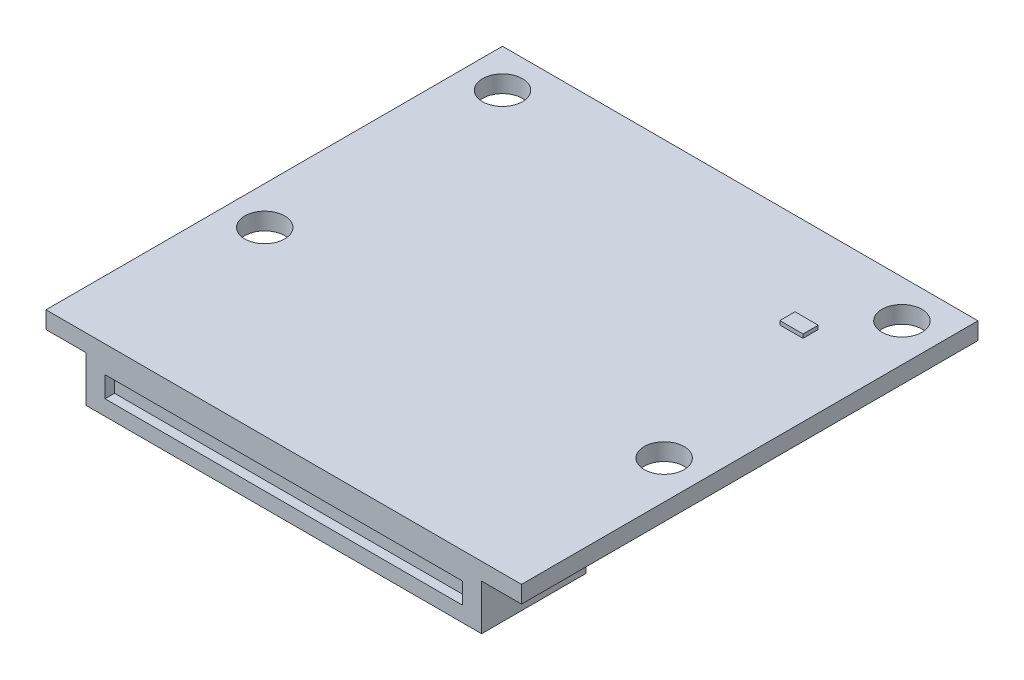
ISO-10303-21;
HEADER;
FILE_DESCRIPTION(('STEP AP214'),'2;1');
FILE_NAME('part.step','',(''),(''),'','','');
FILE_SCHEMA(('AUTOMOTIVE_DESIGN { 1 0 10303 214 1 1 1 1 }'));
ENDSEC;
DATA;
#1=APPLICATION_CONTEXT('core data for automotive mechanical design processes');
#2=APPLICATION_PROTOCOL_DEFINITION('international standard','automotive_design',2000,#1);
#3=PRODUCT_CONTEXT('',#1,'mechanical');
#4=PRODUCT('Part','Part','',(#3));
#5=PRODUCT_RELATED_PRODUCT_CATEGORY('part','',(#4));
#6=PRODUCT_DEFINITION_FORMATION('','',#4);
#7=PRODUCT_DEFINITION_CONTEXT('part definition',#1,'design');
#8=PRODUCT_DEFINITION('design','',#6,#7);
#9=PRODUCT_DEFINITION_SHAPE('','',#8);
#10=(LENGTH_UNIT() NAMED_UNIT(*) SI_UNIT(.MILLI.,.METRE.));
#11=(NAMED_UNIT(*) PLANE_ANGLE_UNIT() SI_UNIT($,.RADIAN.));
#12=(NAMED_UNIT(*) SI_UNIT($,.STERADIAN.) SOLID_ANGLE_UNIT());
#13=UNCERTAINTY_MEASURE_WITH_UNIT(LENGTH_MEASURE(1.E-05),#10,'distance_accuracy_value','');
#14=(GEOMETRIC_REPRESENTATION_CONTEXT(3) GLOBAL_UNCERTAINTY_ASSIGNED_CONTEXT((#13)) GLOBAL_UNIT_ASSIGNED_CONTEXT((#10,
#11,#12)) REPRESENTATION_CONTEXT('',''));
#15=CARTESIAN_POINT('',(0.,0.,0.));
#16=DIRECTION('',(0.,0.,1.));
#17=DIRECTION('',(1.,0.,0.));
#18=AXIS2_PLACEMENT_3D('',#15,#16,#17);
#19=CARTESIAN_POINT('',(0.,0.,0.));
#20=DIRECTION('',(0.,1.,0.));
#21=DIRECTION('',(0.,0.,1.));
#22=AXIS2_PLACEMENT_3D('',#19,#20,#21);
#23=PLANE('',#22);
#24=DIRECTION('',(0.,0.,1.));
#25=VECTOR('',#24,1.);
#26=CARTESIAN_POINT('',(-12.5,0.,-14.5));
#27=LINE('',#26,#25);
#28=CARTESIAN_POINT('',(-12.5,0.,-14.5));
#29=VERTEX_POINT('',#28);
#30=CARTESIAN_POINT('',(-12.5,0.,9.5));
#31=VERTEX_POINT('',#30);
#32=EDGE_CURVE('E273',#29,#31,#27,.T.);
#33=ORIENTED_EDGE('',*,*,#32,.T.);
#34=DIRECTION('',(1.,0.,0.));
#35=VECTOR('',#34,1.);
#36=CARTESIAN_POINT('',(-12.5,0.,9.5));
#37=LINE('',#36,#35);
#38=CARTESIAN_POINT('',(12.5,0.,9.5));
#39=VERTEX_POINT('',#38);
#40=EDGE_CURVE('E276',#31,#39,#37,.T.);
#41=ORIENTED_EDGE('',*,*,#40,.T.);
#42=DIRECTION('',(0.,0.,-1.));
#43=VECTOR('',#42,1.);
#44=CARTESIAN_POINT('',(12.5,0.,-14.5));
#45=LINE('',#44,#43);
#46=CARTESIAN_POINT('',(12.5,0.,-14.5));
#47=VERTEX_POINT('',#46);
#48=EDGE_CURVE('E280',#39,#47,#45,.T.);
#49=ORIENTED_EDGE('',*,*,#48,.T.);
#50=DIRECTION('',(-1.,0.,0.));
#51=VECTOR('',#50,1.);
#52=CARTESIAN_POINT('',(-12.5,0.,-14.5));
#53=LINE('',#52,#51);
#54=EDGE_CURVE('E283',#47,#29,#53,.T.);
#55=ORIENTED_EDGE('',*,*,#54,.T.);
#56=EDGE_LOOP('',(#33,#41,#49,#55));
#57=FACE_BOUND('',#56,.T.);
#58=CARTESIAN_POINT('',(10.5,0.,-12.5));
#59=DIRECTION('',(0.,1.,0.));
#60=DIRECTION('',(0.,0.,1.));
#61=AXIS2_PLACEMENT_3D('',#58,#59,#60);
#62=CIRCLE('',#61,1.05);
#63=CARTESIAN_POINT('',(10.5,0.,-11.45));
#64=VERTEX_POINT('',#63);
#65=EDGE_CURVE('E335',#64,#64,#62,.T.);
#66=ORIENTED_EDGE('',*,*,#65,.F.);
#67=EDGE_LOOP('',(#66));
#68=FACE_BOUND('',#67,.T.);
#69=CARTESIAN_POINT('',(10.5,0.,0.));
#70=DIRECTION('',(0.,1.,0.));
#71=DIRECTION('',(0.,0.,1.));
#72=AXIS2_PLACEMENT_3D('',#69,#70,#71);
#73=CIRCLE('',#72,1.05);
#74=CARTESIAN_POINT('',(10.5,0.,1.05));
#75=VERTEX_POINT('',#74);
#76=EDGE_CURVE('E329',#75,#75,#73,.T.);
#77=ORIENTED_EDGE('',*,*,#76,.F.);
#78=EDGE_LOOP('',(#77));
#79=FACE_BOUND('',#78,.T.);
#80=CARTESIAN_POINT('',(-10.5,0.,0.));
#81=DIRECTION('',(0.,1.,0.));
#82=DIRECTION('',(0.,0.,-1.));
#83=AXIS2_PLACEMENT_3D('',#80,#81,#82);
#84=CIRCLE('',#83,1.05);
#85=CARTESIAN_POINT('',(-10.5,0.,-1.05));
#86=VERTEX_POINT('',#85);
#87=EDGE_CURVE('E324',#86,#86,#84,.T.);
#88=ORIENTED_EDGE('',*,*,#87,.F.);
#89=EDGE_LOOP('',(#88));
#90=FACE_BOUND('',#89,.T.);
#91=CARTESIAN_POINT('',(-10.5,0.,-12.5));
#92=DIRECTION('',(0.,1.,0.));
#93=DIRECTION('',(0.,0.,-1.));
#94=AXIS2_PLACEMENT_3D('',#91,#92,#93);
#95=CIRCLE('',#94,1.05);
#96=CARTESIAN_POINT('',(-10.5,0.,-13.55));
#97=VERTEX_POINT('',#96);
#98=EDGE_CURVE('E318',#97,#97,#95,.T.);
#99=ORIENTED_EDGE('',*,*,#98,.F.);
#100=EDGE_LOOP('',(#99));
#101=FACE_BOUND('',#100,.T.);
#102=DIRECTION('',(-1.,0.,0.));
#103=VECTOR('',#102,1.);
#104=CARTESIAN_POINT('',(8.7,0.,-9.9));
#105=LINE('',#104,#103);
#106=CARTESIAN_POINT('',(8.7,0.,-9.9));
#107=VERTEX_POINT('',#106);
#108=CARTESIAN_POINT('',(7.48,0.,-9.9));
#109=VERTEX_POINT('',#108);
#110=EDGE_CURVE('E202',#107,#109,#105,.T.);
#111=ORIENTED_EDGE('',*,*,#110,.F.);
#112=DIRECTION('',(0.,0.,-1.));
#113=VECTOR('',#112,1.);
#114=CARTESIAN_POINT('',(8.7,0.,-9.1));
#115=LINE('',#114,#113);
#116=CARTESIAN_POINT('',(8.7,0.,-9.1));
#117=VERTEX_POINT('',#116);
#118=EDGE_CURVE('E185',#117,#107,#115,.T.);
#119=ORIENTED_EDGE('',*,*,#118,.F.);
#120=DIRECTION('',(1.,0.,0.));
#121=VECTOR('',#120,1.);
#122=CARTESIAN_POINT('',(8.7,0.,-9.1));
#123=LINE('',#122,#121);
#124=CARTESIAN_POINT('',(7.48,0.,-9.1));
#125=VERTEX_POINT('',#124);
#126=EDGE_CURVE('E193',#125,#117,#123,.T.);
#127=ORIENTED_EDGE('',*,*,#126,.F.);
#128=DIRECTION('',(0.,0.,1.));
#129=VECTOR('',#128,1.);
#130=CARTESIAN_POINT('',(7.48,0.,-9.1));
#131=LINE('',#130,#129);
#132=EDGE_CURVE('E204',#109,#125,#131,.T.);
#133=ORIENTED_EDGE('',*,*,#132,.F.);
#134=EDGE_LOOP('',(#111,#119,#127,#133));
#135=FACE_BOUND('',#134,.T.);
#136=ADVANCED_FACE('F35',(#57,#68,#79,#90,#101,#135),#23,.T.);
#137=CARTESIAN_POINT('',(0.,-0.9,0.));
#138=DIRECTION('',(0.,1.,0.));
#139=DIRECTION('',(0.,0.,1.));
#140=AXIS2_PLACEMENT_3D('',#137,#138,#139);
#141=PLANE('',#140);
#142=CARTESIAN_POINT('',(10.5,-0.9,-12.5));
#143=DIRECTION('',(0.,1.,0.));
#144=DIRECTION('',(0.,0.,1.));
#145=AXIS2_PLACEMENT_3D('',#142,#143,#144);
#146=CIRCLE('',#145,1.05);
#147=CARTESIAN_POINT('',(10.5,-0.9,-11.45));
#148=VERTEX_POINT('',#147);
#149=EDGE_CURVE('E277',#148,#148,#146,.T.);
#150=ORIENTED_EDGE('',*,*,#149,.T.);
#151=EDGE_LOOP('',(#150));
#152=FACE_BOUND('',#151,.T.);
#153=CARTESIAN_POINT('',(10.5,-0.9,0.));
#154=DIRECTION('',(0.,1.,0.));
#155=DIRECTION('',(0.,0.,1.));
#156=AXIS2_PLACEMENT_3D('',#153,#154,#155);
#157=CIRCLE('',#156,1.05);
#158=CARTESIAN_POINT('',(10.5,-0.9,1.05));
#159=VERTEX_POINT('',#158);
#160=EDGE_CURVE('E332',#159,#159,#157,.T.);
#161=ORIENTED_EDGE('',*,*,#160,.T.);
#162=EDGE_LOOP('',(#161));
#163=FACE_BOUND('',#162,.T.);
#164=CARTESIAN_POINT('',(-10.5,-0.9,0.));
#165=DIRECTION('',(0.,1.,0.));
#166=DIRECTION('',(0.,0.,-1.));
#167=AXIS2_PLACEMENT_3D('',#164,#165,#166);
#168=CIRCLE('',#167,1.05);
#169=CARTESIAN_POINT('',(-10.5,-0.9,-1.05));
#170=VERTEX_POINT('',#169);
#171=EDGE_CURVE('E326',#170,#170,#168,.T.);
#172=ORIENTED_EDGE('',*,*,#171,.T.);
#173=EDGE_LOOP('',(#172));
#174=FACE_BOUND('',#173,.T.);
#175=CARTESIAN_POINT('',(-10.5,-0.9,-12.5));
#176=DIRECTION('',(0.,1.,0.));
#177=DIRECTION('',(0.,0.,-1.));
#178=AXIS2_PLACEMENT_3D('',#175,#176,#177);
#179=CIRCLE('',#178,1.05);
#180=CARTESIAN_POINT('',(-10.5,-0.9,-13.55));
#181=VERTEX_POINT('',#180);
#182=EDGE_CURVE('E320',#181,#181,#179,.T.);
#183=ORIENTED_EDGE('',*,*,#182,.T.);
#184=EDGE_LOOP('',(#183));
#185=FACE_BOUND('',#184,.T.);
#186=DIRECTION('',(0.,0.,-1.));
#187=VECTOR('',#186,1.);
#188=CARTESIAN_POINT('',(-10.4,-0.9,9.5));
#189=LINE('',#188,#187);
#190=CARTESIAN_POINT('',(-10.4,-0.9,9.5));
#191=VERTEX_POINT('',#190);
#192=CARTESIAN_POINT('',(-10.4,-0.9,4.));
#193=VERTEX_POINT('',#192);
#194=EDGE_CURVE('E215',#191,#193,#189,.T.);
#195=ORIENTED_EDGE('',*,*,#194,.F.);
#196=DIRECTION('',(1.,0.,0.));
#197=VECTOR('',#196,1.);
#198=CARTESIAN_POINT('',(-12.5,-0.9,9.5));
#199=LINE('',#198,#197);
#200=CARTESIAN_POINT('',(-12.5,-0.9,9.5));
#201=VERTEX_POINT('',#200);
#202=EDGE_CURVE('E258',#201,#191,#199,.T.);
#203=ORIENTED_EDGE('',*,*,#202,.F.);
#204=DIRECTION('',(0.,0.,1.));
#205=VECTOR('',#204,1.);
#206=CARTESIAN_POINT('',(-12.5,-0.9,-14.5));
#207=LINE('',#206,#205);
#208=CARTESIAN_POINT('',(-12.5,-0.9,-14.5));
#209=VERTEX_POINT('',#208);
#210=EDGE_CURVE('E259',#209,#201,#207,.T.);
#211=ORIENTED_EDGE('',*,*,#210,.F.);
#212=DIRECTION('',(-1.,0.,0.));
#213=VECTOR('',#212,1.);
#214=CARTESIAN_POINT('',(-12.5,-0.9,-14.5));
#215=LINE('',#214,#213);
#216=CARTESIAN_POINT('',(12.5,-0.9,-14.5));
#217=VERTEX_POINT('',#216);
#218=EDGE_CURVE('E269',#217,#209,#215,.T.);
#219=ORIENTED_EDGE('',*,*,#218,.F.);
#220=DIRECTION('',(0.,0.,-1.));
#221=VECTOR('',#220,1.);
#222=CARTESIAN_POINT('',(12.5,-0.9,-14.5));
#223=LINE('',#222,#221);
#224=CARTESIAN_POINT('',(12.5,-0.9,9.5));
#225=VERTEX_POINT('',#224);
#226=EDGE_CURVE('E265',#225,#217,#223,.T.);
#227=ORIENTED_EDGE('',*,*,#226,.F.);
#228=CARTESIAN_POINT('',(10.4,-0.9,9.5));
#229=VERTEX_POINT('',#228);
#230=EDGE_CURVE('E255',#229,#225,#199,.T.);
#231=ORIENTED_EDGE('',*,*,#230,.F.);
#232=DIRECTION('',(0.,0.,1.));
#233=VECTOR('',#232,1.);
#234=CARTESIAN_POINT('',(10.4,-0.9,9.5));
#235=LINE('',#234,#233);
#236=CARTESIAN_POINT('',(10.4,-0.9,4.));
#237=VERTEX_POINT('',#236);
#238=EDGE_CURVE('E220',#237,#229,#235,.T.);
#239=ORIENTED_EDGE('',*,*,#238,.F.);
#240=DIRECTION('',(1.,0.,0.));
#241=VECTOR('',#240,1.);
#242=CARTESIAN_POINT('',(-10.4,-0.9,4.));
#243=LINE('',#242,#241);
#244=EDGE_CURVE('E227',#193,#237,#243,.T.);
#245=ORIENTED_EDGE('',*,*,#244,.F.);
#246=EDGE_LOOP('',(#195,#203,#211,#219,#227,#231,#239,#245));
#247=FACE_BOUND('',#246,.T.);
#248=ADVANCED_FACE('F305',(#152,#163,#174,#185,#247),#141,.F.);
#249=CARTESIAN_POINT('',(-12.5,-0.9,-14.5));
#250=DIRECTION('',(-1.,0.,0.));
#251=DIRECTION('',(0.,0.,1.));
#252=AXIS2_PLACEMENT_3D('',#249,#250,#251);
#253=PLANE('',#252);
#254=ORIENTED_EDGE('',*,*,#32,.F.);
#255=DIRECTION('',(0.,1.,0.));
#256=VECTOR('',#255,1.);
#257=CARTESIAN_POINT('',(-12.5,-0.9,-14.5));
#258=LINE('',#257,#256);
#259=EDGE_CURVE('E11',#209,#29,#258,.T.);
#260=ORIENTED_EDGE('',*,*,#259,.F.);
#261=ORIENTED_EDGE('',*,*,#210,.T.);
#262=DIRECTION('',(0.,1.,0.));
#263=VECTOR('',#262,1.);
#264=CARTESIAN_POINT('',(-12.5,-0.9,9.5));
#265=LINE('',#264,#263);
#266=EDGE_CURVE('E272',#201,#31,#265,.T.);
#267=ORIENTED_EDGE('',*,*,#266,.T.);
#268=EDGE_LOOP('',(#254,#260,#261,#267));
#269=FACE_BOUND('',#268,.T.);
#270=ADVANCED_FACE('F37',(#269),#253,.T.);
#271=CARTESIAN_POINT('',(-12.5,-0.9,-14.5));
#272=DIRECTION('',(0.,0.,-1.));
#273=DIRECTION('',(-1.,0.,0.));
#274=AXIS2_PLACEMENT_3D('',#271,#272,#273);
#275=PLANE('',#274);
#276=ORIENTED_EDGE('',*,*,#54,.F.);
#277=DIRECTION('',(0.,1.,0.));
#278=VECTOR('',#277,1.);
#279=CARTESIAN_POINT('',(12.5,-0.9,-14.5));
#280=LINE('',#279,#278);
#281=EDGE_CURVE('E44',#217,#47,#280,.T.);
#282=ORIENTED_EDGE('',*,*,#281,.F.);
#283=ORIENTED_EDGE('',*,*,#218,.T.);
#284=ORIENTED_EDGE('',*,*,#259,.T.);
#285=EDGE_LOOP('',(#276,#282,#283,#284));
#286=FACE_BOUND('',#285,.T.);
#287=ADVANCED_FACE('F302',(#286),#275,.T.);
#288=CARTESIAN_POINT('',(12.5,-0.9,-14.5));
#289=DIRECTION('',(1.,0.,0.));
#290=DIRECTION('',(0.,0.,-1.));
#291=AXIS2_PLACEMENT_3D('',#288,#289,#290);
#292=PLANE('',#291);
#293=ORIENTED_EDGE('',*,*,#48,.F.);
#294=DIRECTION('',(0.,1.,0.));
#295=VECTOR('',#294,1.);
#296=CARTESIAN_POINT('',(12.5,-0.9,9.5));
#297=LINE('',#296,#295);
#298=EDGE_CURVE('E287',#225,#39,#297,.T.);
#299=ORIENTED_EDGE('',*,*,#298,.F.);
#300=ORIENTED_EDGE('',*,*,#226,.T.);
#301=ORIENTED_EDGE('',*,*,#281,.T.);
#302=EDGE_LOOP('',(#293,#299,#300,#301));
#303=FACE_BOUND('',#302,.T.);
#304=ADVANCED_FACE('F412',(#303),#292,.T.);
#305=CARTESIAN_POINT('',(-12.5,-0.9,9.5));
#306=DIRECTION('',(0.,0.,1.));
#307=DIRECTION('',(1.,0.,0.));
#308=AXIS2_PLACEMENT_3D('',#305,#306,#307);
#309=PLANE('',#308);
#310=DIRECTION('',(0.,-1.,0.));
#311=VECTOR('',#310,1.);
#312=CARTESIAN_POINT('',(-9.4,-1.4,9.5));
#313=LINE('',#312,#311);
#314=CARTESIAN_POINT('',(-9.4,-1.4,9.5));
#315=VERTEX_POINT('',#314);
#316=CARTESIAN_POINT('',(-9.4,-2.5,9.5));
#317=VERTEX_POINT('',#316);
#318=EDGE_CURVE('E52',#315,#317,#313,.T.);
#319=ORIENTED_EDGE('',*,*,#318,.F.);
#320=DIRECTION('',(-1.,0.,0.));
#321=VECTOR('',#320,1.);
#322=CARTESIAN_POINT('',(-9.4,-1.4,9.5));
#323=LINE('',#322,#321);
#324=CARTESIAN_POINT('',(9.4,-1.4,9.5));
#325=VERTEX_POINT('',#324);
#326=EDGE_CURVE('E170',#325,#315,#323,.T.);
#327=ORIENTED_EDGE('',*,*,#326,.F.);
#328=DIRECTION('',(0.,1.,0.));
#329=VECTOR('',#328,1.);
#330=CARTESIAN_POINT('',(9.4,-1.4,9.5));
#331=LINE('',#330,#329);
#332=CARTESIAN_POINT('',(9.4,-2.5,9.5));
#333=VERTEX_POINT('',#332);
#334=EDGE_CURVE('E173',#333,#325,#331,.T.);
#335=ORIENTED_EDGE('',*,*,#334,.F.);
#336=DIRECTION('',(1.,0.,0.));
#337=VECTOR('',#336,1.);
#338=CARTESIAN_POINT('',(-9.4,-2.5,9.5));
#339=LINE('',#338,#337);
#340=EDGE_CURVE('E179',#317,#333,#339,.T.);
#341=ORIENTED_EDGE('',*,*,#340,.F.);
#342=EDGE_LOOP('',(#319,#327,#335,#341));
#343=FACE_BOUND('',#342,.T.);
#344=ORIENTED_EDGE('',*,*,#40,.F.);
#345=ORIENTED_EDGE('',*,*,#266,.F.);
#346=ORIENTED_EDGE('',*,*,#202,.T.);
#347=DIRECTION('',(0.,1.,0.));
#348=VECTOR('',#347,1.);
#349=CARTESIAN_POINT('',(-10.4,-3.3,9.5));
#350=LINE('',#349,#348);
#351=CARTESIAN_POINT('',(-10.4,-3.3,9.5));
#352=VERTEX_POINT('',#351);
#353=EDGE_CURVE('E226',#352,#191,#350,.T.);
#354=ORIENTED_EDGE('',*,*,#353,.F.);
#355=DIRECTION('',(-1.,0.,0.));
#356=VECTOR('',#355,1.);
#357=CARTESIAN_POINT('',(-10.4,-3.3,9.5));
#358=LINE('',#357,#356);
#359=CARTESIAN_POINT('',(10.4,-3.3,9.5));
#360=VERTEX_POINT('',#359);
#361=EDGE_CURVE('E224',#360,#352,#358,.T.);
#362=ORIENTED_EDGE('',*,*,#361,.F.);
#363=DIRECTION('',(0.,1.,0.));
#364=VECTOR('',#363,1.);
#365=CARTESIAN_POINT('',(10.4,-3.3,9.5));
#366=LINE('',#365,#364);
#367=EDGE_CURVE('E239',#360,#229,#366,.T.);
#368=ORIENTED_EDGE('',*,*,#367,.T.);
#369=ORIENTED_EDGE('',*,*,#230,.T.);
#370=ORIENTED_EDGE('',*,*,#298,.T.);
#371=EDGE_LOOP('',(#344,#345,#346,#354,#362,#368,#369,#370));
#372=FACE_BOUND('',#371,.T.);
#373=ADVANCED_FACE('F295',(#343,#372),#309,.T.);
#374=CARTESIAN_POINT('',(10.5,-0.9,-12.5));
#375=DIRECTION('',(0.,1.,0.));
#376=DIRECTION('',(0.,0.,1.));
#377=AXIS2_PLACEMENT_3D('',#374,#375,#376);
#378=CYLINDRICAL_SURFACE('',#377,1.05);
#379=ORIENTED_EDGE('',*,*,#149,.F.);
#380=EDGE_LOOP('',(#379));
#381=FACE_BOUND('',#380,.T.);
#382=ORIENTED_EDGE('',*,*,#65,.T.);
#383=EDGE_LOOP('',(#382));
#384=FACE_BOUND('',#383,.T.);
#385=ADVANCED_FACE('F342',(#381,#384),#378,.F.);
#386=CARTESIAN_POINT('',(10.5,-0.9,0.));
#387=DIRECTION('',(0.,1.,0.));
#388=DIRECTION('',(0.,0.,1.));
#389=AXIS2_PLACEMENT_3D('',#386,#387,#388);
#390=CYLINDRICAL_SURFACE('',#389,1.05);
#391=ORIENTED_EDGE('',*,*,#160,.F.);
#392=EDGE_LOOP('',(#391));
#393=FACE_BOUND('',#392,.T.);
#394=ORIENTED_EDGE('',*,*,#76,.T.);
#395=EDGE_LOOP('',(#394));
#396=FACE_BOUND('',#395,.T.);
#397=ADVANCED_FACE('F399',(#393,#396),#390,.F.);
#398=CARTESIAN_POINT('',(-10.5,-0.9,0.));
#399=DIRECTION('',(0.,1.,0.));
#400=DIRECTION('',(0.,0.,1.));
#401=AXIS2_PLACEMENT_3D('',#398,#399,#400);
#402=CYLINDRICAL_SURFACE('',#401,1.05);
#403=ORIENTED_EDGE('',*,*,#171,.F.);
#404=EDGE_LOOP('',(#403));
#405=FACE_BOUND('',#404,.T.);
#406=ORIENTED_EDGE('',*,*,#87,.T.);
#407=EDGE_LOOP('',(#406));
#408=FACE_BOUND('',#407,.T.);
#409=ADVANCED_FACE('F395',(#405,#408),#402,.F.);
#410=CARTESIAN_POINT('',(-10.5,-0.9,-12.5));
#411=DIRECTION('',(0.,1.,0.));
#412=DIRECTION('',(0.,0.,1.));
#413=AXIS2_PLACEMENT_3D('',#410,#411,#412);
#414=CYLINDRICAL_SURFACE('',#413,1.05);
#415=ORIENTED_EDGE('',*,*,#182,.F.);
#416=EDGE_LOOP('',(#415));
#417=FACE_BOUND('',#416,.T.);
#418=ORIENTED_EDGE('',*,*,#98,.T.);
#419=EDGE_LOOP('',(#418));
#420=FACE_BOUND('',#419,.T.);
#421=ADVANCED_FACE('F392',(#417,#420),#414,.F.);
#422=CARTESIAN_POINT('',(-10.4,-3.3,9.5));
#423=DIRECTION('',(1.,0.,0.));
#424=DIRECTION('',(0.,0.,-1.));
#425=AXIS2_PLACEMENT_3D('',#422,#423,#424);
#426=PLANE('',#425);
#427=ORIENTED_EDGE('',*,*,#194,.T.);
#428=DIRECTION('',(0.,1.,0.));
#429=VECTOR('',#428,1.);
#430=CARTESIAN_POINT('',(-10.4,-3.3,4.));
#431=LINE('',#430,#429);
#432=CARTESIAN_POINT('',(-10.4,-3.3,4.));
#433=VERTEX_POINT('',#432);
#434=EDGE_CURVE('E245',#433,#193,#431,.T.);
#435=ORIENTED_EDGE('',*,*,#434,.F.);
#436=DIRECTION('',(0.,0.,-1.));
#437=VECTOR('',#436,1.);
#438=CARTESIAN_POINT('',(-10.4,-3.3,9.5));
#439=LINE('',#438,#437);
#440=EDGE_CURVE('E216',#352,#433,#439,.T.);
#441=ORIENTED_EDGE('',*,*,#440,.F.);
#442=ORIENTED_EDGE('',*,*,#353,.T.);
#443=EDGE_LOOP('',(#427,#435,#441,#442));
#444=FACE_BOUND('',#443,.T.);
#445=ADVANCED_FACE('F308',(#444),#426,.F.);
#446=CARTESIAN_POINT('',(-10.4,-3.3,4.));
#447=DIRECTION('',(0.,0.,1.));
#448=DIRECTION('',(1.,0.,0.));
#449=AXIS2_PLACEMENT_3D('',#446,#447,#448);
#450=PLANE('',#449);
#451=ORIENTED_EDGE('',*,*,#244,.T.);
#452=DIRECTION('',(0.,1.,0.));
#453=VECTOR('',#452,1.);
#454=CARTESIAN_POINT('',(10.4,-3.3,4.));
#455=LINE('',#454,#453);
#456=CARTESIAN_POINT('',(10.4,-3.3,4.));
#457=VERTEX_POINT('',#456);
#458=EDGE_CURVE('E232',#457,#237,#455,.T.);
#459=ORIENTED_EDGE('',*,*,#458,.F.);
#460=DIRECTION('',(1.,0.,0.));
#461=VECTOR('',#460,1.);
#462=CARTESIAN_POINT('',(-10.4,-3.3,4.));
#463=LINE('',#462,#461);
#464=EDGE_CURVE('E219',#433,#457,#463,.T.);
#465=ORIENTED_EDGE('',*,*,#464,.F.);
#466=ORIENTED_EDGE('',*,*,#434,.T.);
#467=EDGE_LOOP('',(#451,#459,#465,#466));
#468=FACE_BOUND('',#467,.T.);
#469=ADVANCED_FACE('F317',(#468),#450,.F.);
#470=CARTESIAN_POINT('',(10.4,-3.3,9.5));
#471=DIRECTION('',(-1.,0.,0.));
#472=DIRECTION('',(0.,0.,1.));
#473=AXIS2_PLACEMENT_3D('',#470,#471,#472);
#474=PLANE('',#473);
#475=ORIENTED_EDGE('',*,*,#238,.T.);
#476=ORIENTED_EDGE('',*,*,#367,.F.);
#477=DIRECTION('',(0.,0.,1.));
#478=VECTOR('',#477,1.);
#479=CARTESIAN_POINT('',(10.4,-3.3,9.5));
#480=LINE('',#479,#478);
#481=EDGE_CURVE('E222',#457,#360,#480,.T.);
#482=ORIENTED_EDGE('',*,*,#481,.F.);
#483=ORIENTED_EDGE('',*,*,#458,.T.);
#484=EDGE_LOOP('',(#475,#476,#482,#483));
#485=FACE_BOUND('',#484,.T.);
#486=ADVANCED_FACE('F315',(#485),#474,.F.);
#487=CARTESIAN_POINT('',(0.,-3.3,0.));
#488=DIRECTION('',(0.,-1.,0.));
#489=DIRECTION('',(0.,0.,-1.));
#490=AXIS2_PLACEMENT_3D('',#487,#488,#489);
#491=PLANE('',#490);
#492=ORIENTED_EDGE('',*,*,#440,.T.);
#493=ORIENTED_EDGE('',*,*,#464,.T.);
#494=ORIENTED_EDGE('',*,*,#481,.T.);
#495=ORIENTED_EDGE('',*,*,#361,.T.);
#496=EDGE_LOOP('',(#492,#493,#494,#495));
#497=FACE_BOUND('',#496,.T.);
#498=ADVANCED_FACE('F311',(#497),#491,.T.);
#499=CARTESIAN_POINT('',(8.7,0.2,-9.1));
#500=DIRECTION('',(-1.,0.,0.));
#501=DIRECTION('',(0.,0.,1.));
#502=AXIS2_PLACEMENT_3D('',#499,#500,#501);
#503=PLANE('',#502);
#504=ORIENTED_EDGE('',*,*,#118,.T.);
#505=DIRECTION('',(0.,-1.,0.));
#506=VECTOR('',#505,1.);
#507=CARTESIAN_POINT('',(8.7,0.2,-9.9));
#508=LINE('',#507,#506);
#509=CARTESIAN_POINT('',(8.7,0.2,-9.9));
#510=VERTEX_POINT('',#509);
#511=EDGE_CURVE('E213',#510,#107,#508,.T.);
#512=ORIENTED_EDGE('',*,*,#511,.F.);
#513=DIRECTION('',(0.,0.,-1.));
#514=VECTOR('',#513,1.);
#515=CARTESIAN_POINT('',(8.7,0.2,-9.1));
#516=LINE('',#515,#514);
#517=CARTESIAN_POINT('',(8.7,0.2,-9.1));
#518=VERTEX_POINT('',#517);
#519=EDGE_CURVE('E189',#518,#510,#516,.T.);
#520=ORIENTED_EDGE('',*,*,#519,.F.);
#521=DIRECTION('',(0.,-1.,0.));
#522=VECTOR('',#521,1.);
#523=CARTESIAN_POINT('',(8.7,0.2,-9.1));
#524=LINE('',#523,#522);
#525=EDGE_CURVE('E199',#518,#117,#524,.T.);
#526=ORIENTED_EDGE('',*,*,#525,.T.);
#527=EDGE_LOOP('',(#504,#512,#520,#526));
#528=FACE_BOUND('',#527,.T.);
#529=ADVANCED_FACE('F368',(#528),#503,.F.);
#530=CARTESIAN_POINT('',(8.7,0.2,-9.9));
#531=DIRECTION('',(0.,0.,1.));
#532=DIRECTION('',(1.,0.,0.));
#533=AXIS2_PLACEMENT_3D('',#530,#531,#532);
#534=PLANE('',#533);
#535=ORIENTED_EDGE('',*,*,#110,.T.);
#536=DIRECTION('',(0.,-1.,0.));
#537=VECTOR('',#536,1.);
#538=CARTESIAN_POINT('',(7.48,0.2,-9.9));
#539=LINE('',#538,#537);
#540=CARTESIAN_POINT('',(7.48,0.2,-9.9));
#541=VERTEX_POINT('',#540);
#542=EDGE_CURVE('E210',#541,#109,#539,.T.);
#543=ORIENTED_EDGE('',*,*,#542,.F.);
#544=DIRECTION('',(-1.,0.,0.));
#545=VECTOR('',#544,1.);
#546=CARTESIAN_POINT('',(8.7,0.2,-9.9));
#547=LINE('',#546,#545);
#548=EDGE_CURVE('E192',#510,#541,#547,.T.);
#549=ORIENTED_EDGE('',*,*,#548,.F.);
#550=ORIENTED_EDGE('',*,*,#511,.T.);
#551=EDGE_LOOP('',(#535,#543,#549,#550));
#552=FACE_BOUND('',#551,.T.);
#553=ADVANCED_FACE('F358',(#552),#534,.F.);
#554=CARTESIAN_POINT('',(7.48,0.2,-9.1));
#555=DIRECTION('',(1.,0.,0.));
#556=DIRECTION('',(0.,0.,-1.));
#557=AXIS2_PLACEMENT_3D('',#554,#555,#556);
#558=PLANE('',#557);
#559=ORIENTED_EDGE('',*,*,#132,.T.);
#560=DIRECTION('',(0.,-1.,0.));
#561=VECTOR('',#560,1.);
#562=CARTESIAN_POINT('',(7.48,0.2,-9.1));
#563=LINE('',#562,#561);
#564=CARTESIAN_POINT('',(7.48,0.2,-9.1));
#565=VERTEX_POINT('',#564);
#566=EDGE_CURVE('E60',#565,#125,#563,.T.);
#567=ORIENTED_EDGE('',*,*,#566,.F.);
#568=DIRECTION('',(0.,0.,1.));
#569=VECTOR('',#568,1.);
#570=CARTESIAN_POINT('',(7.48,0.2,-9.1));
#571=LINE('',#570,#569);
#572=EDGE_CURVE('E195',#541,#565,#571,.T.);
#573=ORIENTED_EDGE('',*,*,#572,.F.);
#574=ORIENTED_EDGE('',*,*,#542,.T.);
#575=EDGE_LOOP('',(#559,#567,#573,#574));
#576=FACE_BOUND('',#575,.T.);
#577=ADVANCED_FACE('F362',(#576),#558,.F.);
#578=CARTESIAN_POINT('',(8.7,0.2,-9.1));
#579=DIRECTION('',(0.,0.,-1.));
#580=DIRECTION('',(-1.,0.,0.));
#581=AXIS2_PLACEMENT_3D('',#578,#579,#580);
#582=PLANE('',#581);
#583=ORIENTED_EDGE('',*,*,#126,.T.);
#584=ORIENTED_EDGE('',*,*,#525,.F.);
#585=DIRECTION('',(1.,0.,0.));
#586=VECTOR('',#585,1.);
#587=CARTESIAN_POINT('',(8.7,0.2,-9.1));
#588=LINE('',#587,#586);
#589=EDGE_CURVE('E197',#565,#518,#588,.T.);
#590=ORIENTED_EDGE('',*,*,#589,.F.);
#591=ORIENTED_EDGE('',*,*,#566,.T.);
#592=EDGE_LOOP('',(#583,#584,#590,#591));
#593=FACE_BOUND('',#592,.T.);
#594=ADVANCED_FACE('F369',(#593),#582,.F.);
#595=CARTESIAN_POINT('',(0.,0.2,0.));
#596=DIRECTION('',(0.,1.,0.));
#597=DIRECTION('',(0.,0.,1.));
#598=AXIS2_PLACEMENT_3D('',#595,#596,#597);
#599=PLANE('',#598);
#600=ORIENTED_EDGE('',*,*,#519,.T.);
#601=ORIENTED_EDGE('',*,*,#548,.T.);
#602=ORIENTED_EDGE('',*,*,#572,.T.);
#603=ORIENTED_EDGE('',*,*,#589,.T.);
#604=EDGE_LOOP('',(#600,#601,#602,#603));
#605=FACE_BOUND('',#604,.T.);
#606=ADVANCED_FACE('F364',(#605),#599,.T.);
#607=CARTESIAN_POINT('',(-9.4,-1.4,9.));
#608=DIRECTION('',(-1.,0.,0.));
#609=DIRECTION('',(0.,0.,1.));
#610=AXIS2_PLACEMENT_3D('',#607,#608,#609);
#611=PLANE('',#610);
#612=ORIENTED_EDGE('',*,*,#318,.T.);
#613=DIRECTION('',(0.,0.,1.));
#614=VECTOR('',#613,1.);
#615=CARTESIAN_POINT('',(-9.4,-2.5,9.));
#616=LINE('',#615,#614);
#617=CARTESIAN_POINT('',(-9.4,-2.5,9.));
#618=VERTEX_POINT('',#617);
#619=EDGE_CURVE('E148',#618,#317,#616,.T.);
#620=ORIENTED_EDGE('',*,*,#619,.F.);
#621=DIRECTION('',(0.,-1.,0.));
#622=VECTOR('',#621,1.);
#623=CARTESIAN_POINT('',(-9.4,-1.4,9.));
#624=LINE('',#623,#622);
#625=CARTESIAN_POINT('',(-9.4,-1.4,9.));
#626=VERTEX_POINT('',#625);
#627=EDGE_CURVE('E152',#626,#618,#624,.T.);
#628=ORIENTED_EDGE('',*,*,#627,.F.);
#629=DIRECTION('',(0.,0.,1.));
#630=VECTOR('',#629,1.);
#631=CARTESIAN_POINT('',(-9.4,-1.4,9.));
#632=LINE('',#631,#630);
#633=EDGE_CURVE('E183',#626,#315,#632,.T.);
#634=ORIENTED_EDGE('',*,*,#633,.T.);
#635=EDGE_LOOP('',(#612,#620,#628,#634));
#636=FACE_BOUND('',#635,.T.);
#637=ADVANCED_FACE('F150',(#636),#611,.F.);
#638=CARTESIAN_POINT('',(-9.4,-1.4,9.));
#639=DIRECTION('',(0.,1.,0.));
#640=DIRECTION('',(0.,0.,1.));
#641=AXIS2_PLACEMENT_3D('',#638,#639,#640);
#642=PLANE('',#641);
#643=ORIENTED_EDGE('',*,*,#326,.T.);
#644=ORIENTED_EDGE('',*,*,#633,.F.);
#645=DIRECTION('',(-1.,0.,0.));
#646=VECTOR('',#645,1.);
#647=CARTESIAN_POINT('',(-9.4,-1.4,9.));
#648=LINE('',#647,#646);
#649=CARTESIAN_POINT('',(9.4,-1.4,9.));
#650=VERTEX_POINT('',#649);
#651=EDGE_CURVE('E158',#650,#626,#648,.T.);
#652=ORIENTED_EDGE('',*,*,#651,.F.);
#653=DIRECTION('',(0.,0.,1.));
#654=VECTOR('',#653,1.);
#655=CARTESIAN_POINT('',(9.4,-1.4,9.));
#656=LINE('',#655,#654);
#657=EDGE_CURVE('E186',#650,#325,#656,.T.);
#658=ORIENTED_EDGE('',*,*,#657,.T.);
#659=EDGE_LOOP('',(#643,#644,#652,#658));
#660=FACE_BOUND('',#659,.T.);
#661=ADVANCED_FACE('F425',(#660),#642,.F.);
#662=CARTESIAN_POINT('',(9.4,-1.4,9.));
#663=DIRECTION('',(1.,0.,0.));
#664=DIRECTION('',(0.,0.,-1.));
#665=AXIS2_PLACEMENT_3D('',#662,#663,#664);
#666=PLANE('',#665);
#667=ORIENTED_EDGE('',*,*,#334,.T.);
#668=ORIENTED_EDGE('',*,*,#657,.F.);
#669=DIRECTION('',(0.,1.,0.));
#670=VECTOR('',#669,1.);
#671=CARTESIAN_POINT('',(9.4,-1.4,9.));
#672=LINE('',#671,#670);
#673=CARTESIAN_POINT('',(9.4,-2.5,9.));
#674=VERTEX_POINT('',#673);
#675=EDGE_CURVE('E166',#674,#650,#672,.T.);
#676=ORIENTED_EDGE('',*,*,#675,.F.);
#677=DIRECTION('',(0.,0.,1.));
#678=VECTOR('',#677,1.);
#679=CARTESIAN_POINT('',(9.4,-2.5,9.));
#680=LINE('',#679,#678);
#681=EDGE_CURVE('E157',#674,#333,#680,.T.);
#682=ORIENTED_EDGE('',*,*,#681,.T.);
#683=EDGE_LOOP('',(#667,#668,#676,#682));
#684=FACE_BOUND('',#683,.T.);
#685=ADVANCED_FACE('F423',(#684),#666,.F.);
#686=CARTESIAN_POINT('',(-9.4,-2.5,9.));
#687=DIRECTION('',(0.,-1.,0.));
#688=DIRECTION('',(0.,0.,-1.));
#689=AXIS2_PLACEMENT_3D('',#686,#687,#688);
#690=PLANE('',#689);
#691=ORIENTED_EDGE('',*,*,#340,.T.);
#692=ORIENTED_EDGE('',*,*,#681,.F.);
#693=DIRECTION('',(1.,0.,0.));
#694=VECTOR('',#693,1.);
#695=CARTESIAN_POINT('',(-9.4,-2.5,9.));
#696=LINE('',#695,#694);
#697=EDGE_CURVE('E161',#618,#674,#696,.T.);
#698=ORIENTED_EDGE('',*,*,#697,.F.);
#699=ORIENTED_EDGE('',*,*,#619,.T.);
#700=EDGE_LOOP('',(#691,#692,#698,#699));
#701=FACE_BOUND('',#700,.T.);
#702=ADVANCED_FACE('F162',(#701),#690,.F.);
#703=CARTESIAN_POINT('',(0.,0.,9.));
#704=DIRECTION('',(0.,0.,1.));
#705=DIRECTION('',(1.,0.,0.));
#706=AXIS2_PLACEMENT_3D('',#703,#704,#705);
#707=PLANE('',#706);
#708=ORIENTED_EDGE('',*,*,#627,.T.);
#709=ORIENTED_EDGE('',*,*,#697,.T.);
#710=ORIENTED_EDGE('',*,*,#675,.T.);
#711=ORIENTED_EDGE('',*,*,#651,.T.);
#712=EDGE_LOOP('',(#708,#709,#710,#711));
#713=FACE_BOUND('',#712,.T.);
#714=ADVANCED_FACE('F168',(#713),#707,.T.);
#715=CLOSED_SHELL('',(#136,#248,#270,#287,#304,#373,#385,#397,#409,#421,#445,#469,#486,#498,
#529,#553,#577,#594,#606,#637,#661,#685,#702,#714));
#716=MANIFOLD_SOLID_BREP('B2',#715);
#717=ADVANCED_BREP_SHAPE_REPRESENTATION('',(#18,#716),#14);
#718=SHAPE_DEFINITION_REPRESENTATION(#9,#717);
ENDSEC;
END-ISO-10303-21;
